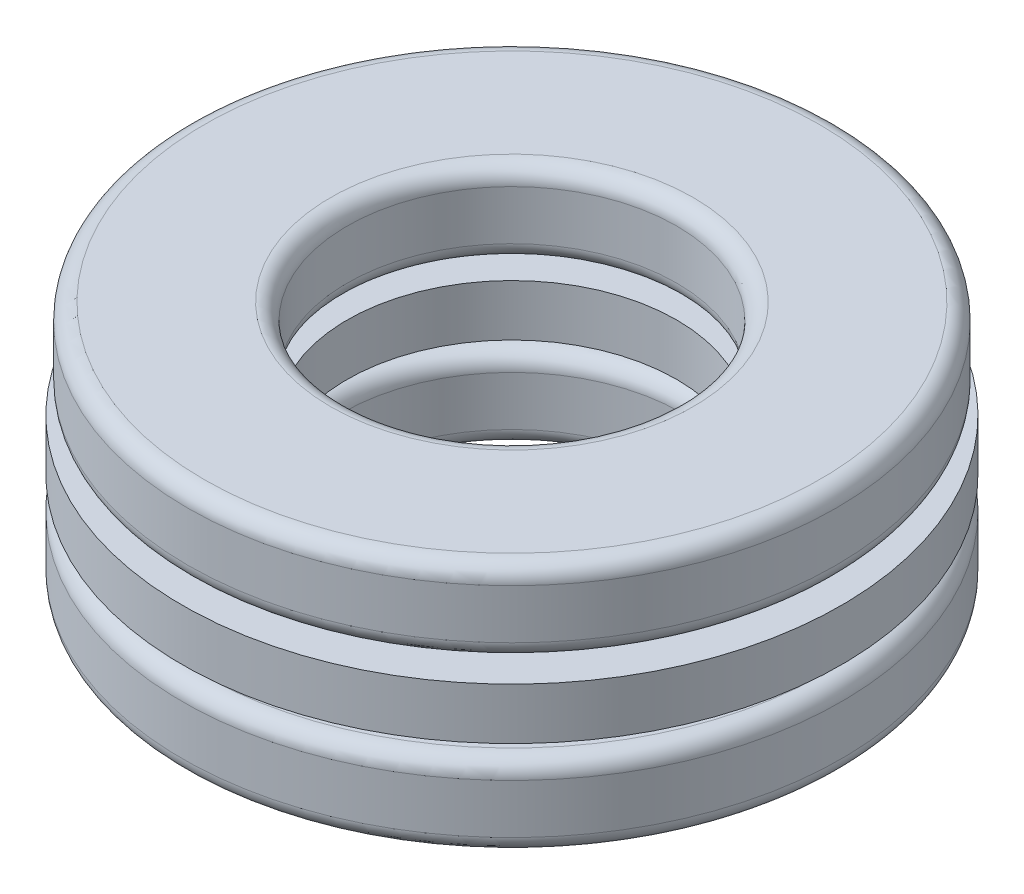
ISO-10303-21;
HEADER;
FILE_DESCRIPTION(('STEP AP214'),'2;1');
FILE_NAME('part.step','',(''),(''),'','','');
FILE_SCHEMA(('AUTOMOTIVE_DESIGN { 1 0 10303 214 1 1 1 1 }'));
ENDSEC;
DATA;
#1=APPLICATION_CONTEXT('core data for automotive mechanical design processes');
#2=APPLICATION_PROTOCOL_DEFINITION('international standard','automotive_design',2000,#1);
#3=PRODUCT_CONTEXT('',#1,'mechanical');
#4=PRODUCT('Part','Part','',(#3));
#5=PRODUCT_RELATED_PRODUCT_CATEGORY('part','',(#4));
#6=PRODUCT_DEFINITION_FORMATION('','',#4);
#7=PRODUCT_DEFINITION_CONTEXT('part definition',#1,'design');
#8=PRODUCT_DEFINITION('design','',#6,#7);
#9=PRODUCT_DEFINITION_SHAPE('','',#8);
#10=(LENGTH_UNIT() NAMED_UNIT(*) SI_UNIT(.MILLI.,.METRE.));
#11=(NAMED_UNIT(*) PLANE_ANGLE_UNIT() SI_UNIT($,.RADIAN.));
#12=(NAMED_UNIT(*) SI_UNIT($,.STERADIAN.) SOLID_ANGLE_UNIT());
#13=UNCERTAINTY_MEASURE_WITH_UNIT(LENGTH_MEASURE(1.E-05),#10,'distance_accuracy_value','');
#14=(GEOMETRIC_REPRESENTATION_CONTEXT(3) GLOBAL_UNCERTAINTY_ASSIGNED_CONTEXT((#13)) GLOBAL_UNIT_ASSIGNED_CONTEXT((#10,
#11,#12)) REPRESENTATION_CONTEXT('',''));
#15=CARTESIAN_POINT('',(0.,0.,0.));
#16=DIRECTION('',(0.,0.,1.));
#17=DIRECTION('',(1.,0.,0.));
#18=AXIS2_PLACEMENT_3D('',#15,#16,#17);
#19=CARTESIAN_POINT('',(0.,-1.05,0.));
#20=DIRECTION('',(0.,-1.,0.));
#21=DIRECTION('',(0.,0.,-1.));
#22=AXIS2_PLACEMENT_3D('',#19,#20,#21);
#23=TOROIDAL_SURFACE('',#22,3.4,0.3);
#24=CARTESIAN_POINT('',(0.,-0.749999999999999,0.));
#25=DIRECTION('',(0.,-1.,0.));
#26=DIRECTION('',(0.,0.,-1.));
#27=AXIS2_PLACEMENT_3D('',#24,#25,#26);
#28=CIRCLE('',#27,3.4);
#29=CARTESIAN_POINT('',(0.,-0.749999999999999,-3.4));
#30=VERTEX_POINT('',#29);
#31=EDGE_CURVE('E71',#30,#30,#28,.T.);
#32=ORIENTED_EDGE('',*,*,#31,.F.);
#33=EDGE_LOOP('',(#32));
#34=FACE_BOUND('',#33,.T.);
#35=CARTESIAN_POINT('',(0.,-1.05,0.));
#36=DIRECTION('',(0.,-1.,0.));
#37=DIRECTION('',(0.,0.,-1.));
#38=AXIS2_PLACEMENT_3D('',#35,#36,#37);
#39=CIRCLE('',#38,3.1);
#40=CARTESIAN_POINT('',(0.,-1.05,-3.1));
#41=VERTEX_POINT('',#40);
#42=EDGE_CURVE('E11',#41,#41,#39,.T.);
#43=ORIENTED_EDGE('',*,*,#42,.T.);
#44=EDGE_LOOP('',(#43));
#45=FACE_BOUND('',#44,.T.);
#46=ADVANCED_FACE('F43',(#34,#45),#23,.T.);
#47=CARTESIAN_POINT('',(0.,-2.25,0.));
#48=DIRECTION('',(0.,-1.,0.));
#49=DIRECTION('',(0.,0.,-1.));
#50=AXIS2_PLACEMENT_3D('',#47,#48,#49);
#51=CYLINDRICAL_SURFACE('',#50,3.1);
#52=ORIENTED_EDGE('',*,*,#42,.F.);
#53=EDGE_LOOP('',(#52));
#54=FACE_BOUND('',#53,.T.);
#55=CARTESIAN_POINT('',(0.,-1.95,0.));
#56=DIRECTION('',(0.,-1.,0.));
#57=DIRECTION('',(0.,0.,-1.));
#58=AXIS2_PLACEMENT_3D('',#55,#56,#57);
#59=CIRCLE('',#58,3.1);
#60=CARTESIAN_POINT('',(0.,-1.95,-3.1));
#61=VERTEX_POINT('',#60);
#62=EDGE_CURVE('E49',#61,#61,#59,.T.);
#63=ORIENTED_EDGE('',*,*,#62,.T.);
#64=EDGE_LOOP('',(#63));
#65=FACE_BOUND('',#64,.T.);
#66=ADVANCED_FACE('F78',(#54,#65),#51,.F.);
#67=CARTESIAN_POINT('',(0.,-1.95,0.));
#68=DIRECTION('',(0.,-1.,0.));
#69=DIRECTION('',(0.,0.,-1.));
#70=AXIS2_PLACEMENT_3D('',#67,#68,#69);
#71=TOROIDAL_SURFACE('',#70,3.4,0.3);
#72=ORIENTED_EDGE('',*,*,#62,.F.);
#73=EDGE_LOOP('',(#72));
#74=FACE_BOUND('',#73,.T.);
#75=CARTESIAN_POINT('',(0.,-2.25,0.));
#76=DIRECTION('',(0.,-1.,0.));
#77=DIRECTION('',(0.,0.,-1.));
#78=AXIS2_PLACEMENT_3D('',#75,#76,#77);
#79=CIRCLE('',#78,3.4);
#80=CARTESIAN_POINT('',(0.,-2.25,-3.4));
#81=VERTEX_POINT('',#80);
#82=EDGE_CURVE('E53',#81,#81,#79,.T.);
#83=ORIENTED_EDGE('',*,*,#82,.T.);
#84=EDGE_LOOP('',(#83));
#85=FACE_BOUND('',#84,.T.);
#86=ADVANCED_FACE('F82',(#74,#85),#71,.T.);
#87=CARTESIAN_POINT('',(0.,-2.25,5.7));
#88=DIRECTION('',(0.,1.,0.));
#89=DIRECTION('',(0.,0.,1.));
#90=AXIS2_PLACEMENT_3D('',#87,#88,#89);
#91=PLANE('',#90);
#92=ORIENTED_EDGE('',*,*,#82,.F.);
#93=EDGE_LOOP('',(#92));
#94=FACE_BOUND('',#93,.T.);
#95=CARTESIAN_POINT('',(0.,-2.25,0.));
#96=DIRECTION('',(0.,-1.,0.));
#97=DIRECTION('',(0.,0.,-1.));
#98=AXIS2_PLACEMENT_3D('',#95,#96,#97);
#99=CIRCLE('',#98,5.7);
#100=CARTESIAN_POINT('',(0.,-2.25,-5.7));
#101=VERTEX_POINT('',#100);
#102=EDGE_CURVE('E57',#101,#101,#99,.T.);
#103=ORIENTED_EDGE('',*,*,#102,.T.);
#104=EDGE_LOOP('',(#103));
#105=FACE_BOUND('',#104,.T.);
#106=ADVANCED_FACE('F87',(#94,#105),#91,.F.);
#107=CARTESIAN_POINT('',(0.,-1.95,0.));
#108=DIRECTION('',(0.,-1.,0.));
#109=DIRECTION('',(0.,0.,-1.));
#110=AXIS2_PLACEMENT_3D('',#107,#108,#109);
#111=TOROIDAL_SURFACE('',#110,5.7,0.299999999999999);
#112=ORIENTED_EDGE('',*,*,#102,.F.);
#113=EDGE_LOOP('',(#112));
#114=FACE_BOUND('',#113,.T.);
#115=CARTESIAN_POINT('',(0.,-1.95,0.));
#116=DIRECTION('',(0.,-1.,0.));
#117=DIRECTION('',(0.,0.,-1.));
#118=AXIS2_PLACEMENT_3D('',#115,#116,#117);
#119=CIRCLE('',#118,6.);
#120=CARTESIAN_POINT('',(0.,-1.95,-6.));
#121=VERTEX_POINT('',#120);
#122=EDGE_CURVE('E62',#121,#121,#119,.T.);
#123=ORIENTED_EDGE('',*,*,#122,.T.);
#124=EDGE_LOOP('',(#123));
#125=FACE_BOUND('',#124,.T.);
#126=ADVANCED_FACE('F93',(#114,#125),#111,.T.);
#127=CARTESIAN_POINT('',(0.,-2.25,0.));
#128=DIRECTION('',(0.,-1.,0.));
#129=DIRECTION('',(0.,0.,-1.));
#130=AXIS2_PLACEMENT_3D('',#127,#128,#129);
#131=CYLINDRICAL_SURFACE('',#130,6.);
#132=ORIENTED_EDGE('',*,*,#122,.F.);
#133=EDGE_LOOP('',(#132));
#134=FACE_BOUND('',#133,.T.);
#135=CARTESIAN_POINT('',(0.,-1.05,0.));
#136=DIRECTION('',(0.,-1.,0.));
#137=DIRECTION('',(0.,0.,-1.));
#138=AXIS2_PLACEMENT_3D('',#135,#136,#137);
#139=CIRCLE('',#138,6.);
#140=CARTESIAN_POINT('',(0.,-1.05,-6.));
#141=VERTEX_POINT('',#140);
#142=EDGE_CURVE('E65',#141,#141,#139,.T.);
#143=ORIENTED_EDGE('',*,*,#142,.T.);
#144=EDGE_LOOP('',(#143));
#145=FACE_BOUND('',#144,.T.);
#146=ADVANCED_FACE('F97',(#134,#145),#131,.T.);
#147=CARTESIAN_POINT('',(0.,-1.05,0.));
#148=DIRECTION('',(0.,-1.,0.));
#149=DIRECTION('',(0.,0.,-1.));
#150=AXIS2_PLACEMENT_3D('',#147,#148,#149);
#151=TOROIDAL_SURFACE('',#150,5.7,0.299999999999999);
#152=ORIENTED_EDGE('',*,*,#142,.F.);
#153=EDGE_LOOP('',(#152));
#154=FACE_BOUND('',#153,.T.);
#155=CARTESIAN_POINT('',(0.,-0.749999999999999,0.));
#156=DIRECTION('',(0.,-1.,0.));
#157=DIRECTION('',(0.,0.,-1.));
#158=AXIS2_PLACEMENT_3D('',#155,#156,#157);
#159=CIRCLE('',#158,5.7);
#160=CARTESIAN_POINT('',(0.,-0.749999999999999,-5.7));
#161=VERTEX_POINT('',#160);
#162=EDGE_CURVE('E68',#161,#161,#159,.T.);
#163=ORIENTED_EDGE('',*,*,#162,.T.);
#164=EDGE_LOOP('',(#163));
#165=FACE_BOUND('',#164,.T.);
#166=ADVANCED_FACE('F101',(#154,#165),#151,.T.);
#167=CARTESIAN_POINT('',(0.,-0.749999999999999,5.7));
#168=DIRECTION('',(0.,-1.,0.));
#169=DIRECTION('',(0.,0.,-1.));
#170=AXIS2_PLACEMENT_3D('',#167,#168,#169);
#171=PLANE('',#170);
#172=ORIENTED_EDGE('',*,*,#162,.F.);
#173=EDGE_LOOP('',(#172));
#174=FACE_BOUND('',#173,.T.);
#175=ORIENTED_EDGE('',*,*,#31,.T.);
#176=EDGE_LOOP('',(#175));
#177=FACE_BOUND('',#176,.T.);
#178=ADVANCED_FACE('F75',(#174,#177),#171,.F.);
#179=CLOSED_SHELL('',(#46,#66,#86,#106,#126,#146,#166,#178));
#180=MANIFOLD_SOLID_BREP('B2',#179);
#181=CARTESIAN_POINT('',(0.,1.05,0.));
#182=DIRECTION('',(0.,-1.,0.));
#183=DIRECTION('',(0.,0.,-1.));
#184=AXIS2_PLACEMENT_3D('',#181,#182,#183);
#185=TOROIDAL_SURFACE('',#184,3.3,0.3);
#186=CARTESIAN_POINT('',(0.,1.05,0.));
#187=DIRECTION('',(0.,-1.,0.));
#188=DIRECTION('',(0.,0.,-1.));
#189=AXIS2_PLACEMENT_3D('',#186,#187,#188);
#190=CIRCLE('',#189,3.);
#191=CARTESIAN_POINT('',(0.,1.05,-3.));
#192=VERTEX_POINT('',#191);
#193=EDGE_CURVE('E42',#192,#192,#190,.T.);
#194=ORIENTED_EDGE('',*,*,#193,.F.);
#195=EDGE_LOOP('',(#194));
#196=FACE_BOUND('',#195,.T.);
#197=CARTESIAN_POINT('',(0.,0.749999999999999,0.));
#198=DIRECTION('',(0.,-1.,0.));
#199=DIRECTION('',(0.,0.,-1.));
#200=AXIS2_PLACEMENT_3D('',#197,#198,#199);
#201=CIRCLE('',#200,3.3);
#202=CARTESIAN_POINT('',(0.,0.749999999999999,-3.3));
#203=VERTEX_POINT('',#202);
#204=EDGE_CURVE('E198',#203,#203,#201,.T.);
#205=ORIENTED_EDGE('',*,*,#204,.T.);
#206=EDGE_LOOP('',(#205));
#207=FACE_BOUND('',#206,.T.);
#208=ADVANCED_FACE('F170',(#196,#207),#185,.T.);
#209=CARTESIAN_POINT('',(0.,-2.25,0.));
#210=DIRECTION('',(0.,-1.,0.));
#211=DIRECTION('',(0.,0.,-1.));
#212=AXIS2_PLACEMENT_3D('',#209,#210,#211);
#213=CYLINDRICAL_SURFACE('',#212,3.);
#214=CARTESIAN_POINT('',(0.,1.95,0.));
#215=DIRECTION('',(0.,-1.,0.));
#216=DIRECTION('',(0.,0.,-1.));
#217=AXIS2_PLACEMENT_3D('',#214,#215,#216);
#218=CIRCLE('',#217,3.);
#219=CARTESIAN_POINT('',(0.,1.95,-3.));
#220=VERTEX_POINT('',#219);
#221=EDGE_CURVE('E176',#220,#220,#218,.T.);
#222=ORIENTED_EDGE('',*,*,#221,.F.);
#223=EDGE_LOOP('',(#222));
#224=FACE_BOUND('',#223,.T.);
#225=ORIENTED_EDGE('',*,*,#193,.T.);
#226=EDGE_LOOP('',(#225));
#227=FACE_BOUND('',#226,.T.);
#228=ADVANCED_FACE('F235',(#224,#227),#213,.F.);
#229=CARTESIAN_POINT('',(0.,1.95,0.));
#230=DIRECTION('',(0.,-1.,0.));
#231=DIRECTION('',(0.,0.,-1.));
#232=AXIS2_PLACEMENT_3D('',#229,#230,#231);
#233=TOROIDAL_SURFACE('',#232,3.3,0.3);
#234=CARTESIAN_POINT('',(0.,2.25,0.));
#235=DIRECTION('',(0.,-1.,0.));
#236=DIRECTION('',(0.,0.,-1.));
#237=AXIS2_PLACEMENT_3D('',#234,#235,#236);
#238=CIRCLE('',#237,3.3);
#239=CARTESIAN_POINT('',(0.,2.25,-3.3));
#240=VERTEX_POINT('',#239);
#241=EDGE_CURVE('E180',#240,#240,#238,.T.);
#242=ORIENTED_EDGE('',*,*,#241,.F.);
#243=EDGE_LOOP('',(#242));
#244=FACE_BOUND('',#243,.T.);
#245=ORIENTED_EDGE('',*,*,#221,.T.);
#246=EDGE_LOOP('',(#245));
#247=FACE_BOUND('',#246,.T.);
#248=ADVANCED_FACE('F230',(#244,#247),#233,.T.);
#249=CARTESIAN_POINT('',(0.,2.25,5.6));
#250=DIRECTION('',(0.,-1.,0.));
#251=DIRECTION('',(0.,0.,-1.));
#252=AXIS2_PLACEMENT_3D('',#249,#250,#251);
#253=PLANE('',#252);
#254=CARTESIAN_POINT('',(0.,2.25,0.));
#255=DIRECTION('',(0.,-1.,0.));
#256=DIRECTION('',(0.,0.,-1.));
#257=AXIS2_PLACEMENT_3D('',#254,#255,#256);
#258=CIRCLE('',#257,5.6);
#259=CARTESIAN_POINT('',(0.,2.25,-5.6));
#260=VERTEX_POINT('',#259);
#261=EDGE_CURVE('E184',#260,#260,#258,.T.);
#262=ORIENTED_EDGE('',*,*,#261,.F.);
#263=EDGE_LOOP('',(#262));
#264=FACE_BOUND('',#263,.T.);
#265=ORIENTED_EDGE('',*,*,#241,.T.);
#266=EDGE_LOOP('',(#265));
#267=FACE_BOUND('',#266,.T.);
#268=ADVANCED_FACE('F224',(#264,#267),#253,.F.);
#269=CARTESIAN_POINT('',(0.,1.95,0.));
#270=DIRECTION('',(0.,-1.,0.));
#271=DIRECTION('',(0.,0.,-1.));
#272=AXIS2_PLACEMENT_3D('',#269,#270,#271);
#273=TOROIDAL_SURFACE('',#272,5.6,0.3);
#274=CARTESIAN_POINT('',(0.,1.95,0.));
#275=DIRECTION('',(0.,-1.,0.));
#276=DIRECTION('',(0.,0.,-1.));
#277=AXIS2_PLACEMENT_3D('',#274,#275,#276);
#278=CIRCLE('',#277,5.9);
#279=CARTESIAN_POINT('',(0.,1.95,-5.9));
#280=VERTEX_POINT('',#279);
#281=EDGE_CURVE('E189',#280,#280,#278,.T.);
#282=ORIENTED_EDGE('',*,*,#281,.F.);
#283=EDGE_LOOP('',(#282));
#284=FACE_BOUND('',#283,.T.);
#285=ORIENTED_EDGE('',*,*,#261,.T.);
#286=EDGE_LOOP('',(#285));
#287=FACE_BOUND('',#286,.T.);
#288=ADVANCED_FACE('F218',(#284,#287),#273,.T.);
#289=CARTESIAN_POINT('',(0.,-2.25,0.));
#290=DIRECTION('',(0.,-1.,0.));
#291=DIRECTION('',(0.,0.,-1.));
#292=AXIS2_PLACEMENT_3D('',#289,#290,#291);
#293=CYLINDRICAL_SURFACE('',#292,5.9);
#294=CARTESIAN_POINT('',(0.,1.05,0.));
#295=DIRECTION('',(0.,-1.,0.));
#296=DIRECTION('',(0.,0.,-1.));
#297=AXIS2_PLACEMENT_3D('',#294,#295,#296);
#298=CIRCLE('',#297,5.9);
#299=CARTESIAN_POINT('',(0.,1.05,-5.9));
#300=VERTEX_POINT('',#299);
#301=EDGE_CURVE('E192',#300,#300,#298,.T.);
#302=ORIENTED_EDGE('',*,*,#301,.F.);
#303=EDGE_LOOP('',(#302));
#304=FACE_BOUND('',#303,.T.);
#305=ORIENTED_EDGE('',*,*,#281,.T.);
#306=EDGE_LOOP('',(#305));
#307=FACE_BOUND('',#306,.T.);
#308=ADVANCED_FACE('F212',(#304,#307),#293,.T.);
#309=CARTESIAN_POINT('',(0.,1.05,0.));
#310=DIRECTION('',(0.,-1.,0.));
#311=DIRECTION('',(0.,0.,-1.));
#312=AXIS2_PLACEMENT_3D('',#309,#310,#311);
#313=TOROIDAL_SURFACE('',#312,5.6,0.299999999999999);
#314=CARTESIAN_POINT('',(0.,0.749999999999999,0.));
#315=DIRECTION('',(0.,-1.,0.));
#316=DIRECTION('',(0.,0.,-1.));
#317=AXIS2_PLACEMENT_3D('',#314,#315,#316);
#318=CIRCLE('',#317,5.6);
#319=CARTESIAN_POINT('',(0.,0.749999999999999,-5.6));
#320=VERTEX_POINT('',#319);
#321=EDGE_CURVE('E195',#320,#320,#318,.T.);
#322=ORIENTED_EDGE('',*,*,#321,.F.);
#323=EDGE_LOOP('',(#322));
#324=FACE_BOUND('',#323,.T.);
#325=ORIENTED_EDGE('',*,*,#301,.T.);
#326=EDGE_LOOP('',(#325));
#327=FACE_BOUND('',#326,.T.);
#328=ADVANCED_FACE('F206',(#324,#327),#313,.T.);
#329=CARTESIAN_POINT('',(0.,0.749999999999999,5.6));
#330=DIRECTION('',(0.,1.,0.));
#331=DIRECTION('',(0.,0.,1.));
#332=AXIS2_PLACEMENT_3D('',#329,#330,#331);
#333=PLANE('',#332);
#334=ORIENTED_EDGE('',*,*,#204,.F.);
#335=EDGE_LOOP('',(#334));
#336=FACE_BOUND('',#335,.T.);
#337=ORIENTED_EDGE('',*,*,#321,.T.);
#338=EDGE_LOOP('',(#337));
#339=FACE_BOUND('',#338,.T.);
#340=ADVANCED_FACE('F203',(#336,#339),#333,.F.);
#341=CLOSED_SHELL('',(#208,#228,#248,#268,#288,#308,#328,#340));
#342=MANIFOLD_SOLID_BREP('B6',#341);
#343=CARTESIAN_POINT('',(-4.27975432332818,0.,1.39057647468731));
#344=DIRECTION('',(0.,1.,0.));
#345=DIRECTION('',(0.95105651629515,0.,-0.309016994374958));
#346=AXIS2_PLACEMENT_3D('',#343,#344,#345);
#347=SPHERICAL_SURFACE('',#346,0.75);
#348=CARTESIAN_POINT('',(-4.27975432332818,0.75,1.39057647468731));
#349=VERTEX_POINT('',#348);
#350=VERTEX_LOOP('',#349);
#351=FACE_BOUND('',#350,.T.);
#352=ADVANCED_FACE('F297',(#351),#347,.T.);
#353=CLOSED_SHELL('',(#352));
#354=MANIFOLD_SOLID_BREP('B37',#353);
#355=CARTESIAN_POINT('',(-2.64503363531616,0.,-3.64057647468724));
#356=DIRECTION('',(0.,1.,0.));
#357=DIRECTION('',(0.58778525229248,0.,0.809016994374942));
#358=AXIS2_PLACEMENT_3D('',#355,#356,#357);
#359=SPHERICAL_SURFACE('',#358,0.75);
#360=CARTESIAN_POINT('',(-2.64503363531616,0.75,-3.64057647468724));
#361=VERTEX_POINT('',#360);
#362=VERTEX_LOOP('',#361);
#363=FACE_BOUND('',#362,.T.);
#364=ADVANCED_FACE('F315',(#363),#359,.T.);
#365=CLOSED_SHELL('',(#364));
#366=MANIFOLD_SOLID_BREP('B166',#365);
#367=CARTESIAN_POINT('',(2.64503363531611,0.,-3.64057647468728));
#368=DIRECTION('',(0.,1.,0.));
#369=DIRECTION('',(-0.587785252292469,0.,0.809016994374951));
#370=AXIS2_PLACEMENT_3D('',#367,#368,#369);
#371=SPHERICAL_SURFACE('',#370,0.75);
#372=CARTESIAN_POINT('',(2.64503363531611,0.75,-3.64057647468728));
#373=VERTEX_POINT('',#372);
#374=VERTEX_LOOP('',#373);
#375=FACE_BOUND('',#374,.T.);
#376=ADVANCED_FACE('F333',(#375),#371,.T.);
#377=CLOSED_SHELL('',(#376));
#378=MANIFOLD_SOLID_BREP('B293',#377);
#379=CARTESIAN_POINT('',(4.2797543233282,0.,1.39057647468725));
#380=DIRECTION('',(0.,1.,0.));
#381=DIRECTION('',(-0.951056516295155,0.,-0.309016994374945));
#382=AXIS2_PLACEMENT_3D('',#379,#380,#381);
#383=SPHERICAL_SURFACE('',#382,0.75);
#384=CARTESIAN_POINT('',(4.2797543233282,0.75,1.39057647468725));
#385=VERTEX_POINT('',#384);
#386=VERTEX_LOOP('',#385);
#387=FACE_BOUND('',#386,.T.);
#388=ADVANCED_FACE('F351',(#387),#383,.T.);
#389=CLOSED_SHELL('',(#388));
#390=MANIFOLD_SOLID_BREP('B311',#389);
#391=CARTESIAN_POINT('',(0.,0.,4.5));
#392=DIRECTION('',(0.,1.,0.));
#393=DIRECTION('',(0.,0.,-1.));
#394=AXIS2_PLACEMENT_3D('',#391,#392,#393);
#395=SPHERICAL_SURFACE('',#394,0.75);
#396=CARTESIAN_POINT('',(0.,0.75,4.5));
#397=VERTEX_POINT('',#396);
#398=VERTEX_LOOP('',#397);
#399=FACE_BOUND('',#398,.T.);
#400=ADVANCED_FACE('F370',(#399),#395,.T.);
#401=CLOSED_SHELL('',(#400));
#402=MANIFOLD_SOLID_BREP('B329',#401);
#403=CARTESIAN_POINT('',(0.,-2.25,0.));
#404=DIRECTION('',(0.,-1.,0.));
#405=DIRECTION('',(0.,0.,-1.));
#406=AXIS2_PLACEMENT_3D('',#403,#404,#405);
#407=CYLINDRICAL_SURFACE('',#406,6.);
#408=CARTESIAN_POINT('',(0.,-0.468750000000001,0.));
#409=DIRECTION('',(0.,-1.,0.));
#410=DIRECTION('',(0.,0.,-1.));
#411=AXIS2_PLACEMENT_3D('',#408,#409,#410);
#412=CIRCLE('',#411,6.);
#413=CARTESIAN_POINT('',(0.,-0.468750000000001,-6.));
#414=VERTEX_POINT('',#413);
#415=EDGE_CURVE('E369',#414,#414,#412,.T.);
#416=ORIENTED_EDGE('',*,*,#415,.F.);
#417=EDGE_LOOP('',(#416));
#418=FACE_BOUND('',#417,.T.);
#419=CARTESIAN_POINT('',(0.,0.468749999999999,0.));
#420=DIRECTION('',(0.,-1.,0.));
#421=DIRECTION('',(0.,0.,-1.));
#422=AXIS2_PLACEMENT_3D('',#419,#420,#421);
#423=CIRCLE('',#422,6.);
#424=CARTESIAN_POINT('',(0.,0.468749999999999,-6.));
#425=VERTEX_POINT('',#424);
#426=EDGE_CURVE('E398',#425,#425,#423,.T.);
#427=ORIENTED_EDGE('',*,*,#426,.T.);
#428=EDGE_LOOP('',(#427));
#429=FACE_BOUND('',#428,.T.);
#430=ADVANCED_FACE('F382',(#418,#429),#407,.T.);
#431=CARTESIAN_POINT('',(0.,-0.468750000000001,6.));
#432=DIRECTION('',(0.,1.,0.));
#433=DIRECTION('',(0.,0.,1.));
#434=AXIS2_PLACEMENT_3D('',#431,#432,#433);
#435=PLANE('',#434);
#436=CARTESIAN_POINT('',(-4.27975432332818,-0.468750000000001,1.39057647468731));
#437=DIRECTION('',(0.,1.,0.));
#438=DIRECTION('',(-0.95105651629515,0.,0.309016994374958));
#439=AXIS2_PLACEMENT_3D('',#436,#437,#438);
#440=CIRCLE('',#439,0.585468562349849);
#441=CARTESIAN_POINT('',(-4.83656801463695,-0.468750000000001,1.57149621012569));
#442=VERTEX_POINT('',#441);
#443=EDGE_CURVE('E422',#442,#442,#440,.T.);
#444=ORIENTED_EDGE('',*,*,#443,.T.);
#445=EDGE_LOOP('',(#444));
#446=FACE_BOUND('',#445,.T.);
#447=CARTESIAN_POINT('',(-2.64503363531616,-0.468750000000001,-3.64057647468724));
#448=DIRECTION('',(0.,1.,0.));
#449=DIRECTION('',(-0.58778525229248,0.,-0.809016994374942));
#450=AXIS2_PLACEMENT_3D('',#447,#448,#449);
#451=CIRCLE('',#450,0.585468562349849);
#452=CARTESIAN_POINT('',(-2.98916342194628,-0.468750000000001,-4.11423049130053));
#453=VERTEX_POINT('',#452);
#454=EDGE_CURVE('E416',#453,#453,#451,.T.);
#455=ORIENTED_EDGE('',*,*,#454,.T.);
#456=EDGE_LOOP('',(#455));
#457=FACE_BOUND('',#456,.T.);
#458=CARTESIAN_POINT('',(2.64503363531611,-0.468750000000001,-3.64057647468728));
#459=DIRECTION('',(0.,1.,0.));
#460=DIRECTION('',(0.587785252292469,0.,-0.809016994374951));
#461=AXIS2_PLACEMENT_3D('',#458,#459,#460);
#462=CIRCLE('',#461,0.585468562349849);
#463=CARTESIAN_POINT('',(2.98916342194622,-0.468750000000001,-4.11423049130058));
#464=VERTEX_POINT('',#463);
#465=EDGE_CURVE('E410',#464,#464,#462,.T.);
#466=ORIENTED_EDGE('',*,*,#465,.T.);
#467=EDGE_LOOP('',(#466));
#468=FACE_BOUND('',#467,.T.);
#469=CARTESIAN_POINT('',(4.2797543233282,-0.468750000000001,1.39057647468725));
#470=DIRECTION('',(0.,1.,0.));
#471=DIRECTION('',(0.951056516295155,0.,0.309016994374945));
#472=AXIS2_PLACEMENT_3D('',#469,#470,#471);
#473=CIRCLE('',#472,0.585468562349849);
#474=CARTESIAN_POINT('',(4.83656801463698,-0.468750000000001,1.57149621012562));
#475=VERTEX_POINT('',#474);
#476=EDGE_CURVE('E404',#475,#475,#473,.T.);
#477=ORIENTED_EDGE('',*,*,#476,.T.);
#478=EDGE_LOOP('',(#477));
#479=FACE_BOUND('',#478,.T.);
#480=CARTESIAN_POINT('',(0.,-0.468750000000001,4.5));
#481=DIRECTION('',(0.,1.,0.));
#482=DIRECTION('',(0.,0.,1.));
#483=AXIS2_PLACEMENT_3D('',#480,#481,#482);
#484=CIRCLE('',#483,0.585468562349849);
#485=CARTESIAN_POINT('',(0.,-0.468750000000001,5.08546856234985));
#486=VERTEX_POINT('',#485);
#487=EDGE_CURVE('E401',#486,#486,#484,.T.);
#488=ORIENTED_EDGE('',*,*,#487,.T.);
#489=EDGE_LOOP('',(#488));
#490=FACE_BOUND('',#489,.T.);
#491=CARTESIAN_POINT('',(0.,-0.468750000000001,0.));
#492=DIRECTION('',(0.,-1.,0.));
#493=DIRECTION('',(0.,0.,-1.));
#494=AXIS2_PLACEMENT_3D('',#491,#492,#493);
#495=CIRCLE('',#494,3.);
#496=CARTESIAN_POINT('',(0.,-0.468750000000001,-3.));
#497=VERTEX_POINT('',#496);
#498=EDGE_CURVE('E389',#497,#497,#495,.T.);
#499=ORIENTED_EDGE('',*,*,#498,.F.);
#500=EDGE_LOOP('',(#499));
#501=FACE_BOUND('',#500,.T.);
#502=ORIENTED_EDGE('',*,*,#415,.T.);
#503=EDGE_LOOP('',(#502));
#504=FACE_BOUND('',#503,.T.);
#505=ADVANCED_FACE('F439',(#446,#457,#468,#479,#490,#501,#504),#435,.F.);
#506=CARTESIAN_POINT('',(0.,-2.25,0.));
#507=DIRECTION('',(0.,-1.,0.));
#508=DIRECTION('',(0.,0.,-1.));
#509=AXIS2_PLACEMENT_3D('',#506,#507,#508);
#510=CYLINDRICAL_SURFACE('',#509,3.);
#511=CARTESIAN_POINT('',(0.,0.46875,0.));
#512=DIRECTION('',(0.,-1.,0.));
#513=DIRECTION('',(0.,0.,-1.));
#514=AXIS2_PLACEMENT_3D('',#511,#512,#513);
#515=CIRCLE('',#514,3.);
#516=CARTESIAN_POINT('',(0.,0.46875,-3.));
#517=VERTEX_POINT('',#516);
#518=EDGE_CURVE('E393',#517,#517,#515,.T.);
#519=ORIENTED_EDGE('',*,*,#518,.F.);
#520=EDGE_LOOP('',(#519));
#521=FACE_BOUND('',#520,.T.);
#522=ORIENTED_EDGE('',*,*,#498,.T.);
#523=EDGE_LOOP('',(#522));
#524=FACE_BOUND('',#523,.T.);
#525=ADVANCED_FACE('F442',(#521,#524),#510,.F.);
#526=CARTESIAN_POINT('',(0.,0.46875,6.));
#527=DIRECTION('',(0.,-1.,0.));
#528=DIRECTION('',(0.,0.,-1.));
#529=AXIS2_PLACEMENT_3D('',#526,#527,#528);
#530=PLANE('',#529);
#531=CARTESIAN_POINT('',(-4.27975432332818,0.46875,1.39057647468731));
#532=DIRECTION('',(0.,-1.,0.));
#533=DIRECTION('',(0.95105651629515,0.,-0.309016994374958));
#534=AXIS2_PLACEMENT_3D('',#531,#532,#533);
#535=CIRCLE('',#534,0.58546856234985);
#536=CARTESIAN_POINT('',(-3.7229406320194,0.46875,1.20965673924893));
#537=VERTEX_POINT('',#536);
#538=EDGE_CURVE('E425',#537,#537,#535,.T.);
#539=ORIENTED_EDGE('',*,*,#538,.T.);
#540=EDGE_LOOP('',(#539));
#541=FACE_BOUND('',#540,.T.);
#542=CARTESIAN_POINT('',(-2.64503363531616,0.46875,-3.64057647468724));
#543=DIRECTION('',(0.,-1.,0.));
#544=DIRECTION('',(0.58778525229248,0.,0.809016994374942));
#545=AXIS2_PLACEMENT_3D('',#542,#543,#544);
#546=CIRCLE('',#545,0.58546856234985);
#547=CARTESIAN_POINT('',(-2.30090384868604,0.46875,-3.16692245807395));
#548=VERTEX_POINT('',#547);
#549=EDGE_CURVE('E419',#548,#548,#546,.T.);
#550=ORIENTED_EDGE('',*,*,#549,.T.);
#551=EDGE_LOOP('',(#550));
#552=FACE_BOUND('',#551,.T.);
#553=CARTESIAN_POINT('',(2.64503363531611,0.46875,-3.64057647468728));
#554=DIRECTION('',(0.,-1.,0.));
#555=DIRECTION('',(-0.587785252292469,0.,0.809016994374951));
#556=AXIS2_PLACEMENT_3D('',#553,#554,#555);
#557=CIRCLE('',#556,0.58546856234985);
#558=CARTESIAN_POINT('',(2.30090384868599,0.46875,-3.16692245807398));
#559=VERTEX_POINT('',#558);
#560=EDGE_CURVE('E413',#559,#559,#557,.T.);
#561=ORIENTED_EDGE('',*,*,#560,.T.);
#562=EDGE_LOOP('',(#561));
#563=FACE_BOUND('',#562,.T.);
#564=CARTESIAN_POINT('',(4.2797543233282,0.46875,1.39057647468725));
#565=DIRECTION('',(0.,-1.,0.));
#566=DIRECTION('',(-0.951056516295155,0.,-0.309016994374945));
#567=AXIS2_PLACEMENT_3D('',#564,#565,#566);
#568=CIRCLE('',#567,0.58546856234985);
#569=CARTESIAN_POINT('',(3.72294063201942,0.46875,1.20965673924888));
#570=VERTEX_POINT('',#569);
#571=EDGE_CURVE('E407',#570,#570,#568,.T.);
#572=ORIENTED_EDGE('',*,*,#571,.T.);
#573=EDGE_LOOP('',(#572));
#574=FACE_BOUND('',#573,.T.);
#575=CARTESIAN_POINT('',(0.,0.46875,4.5));
#576=DIRECTION('',(0.,-1.,0.));
#577=DIRECTION('',(0.,0.,-1.));
#578=AXIS2_PLACEMENT_3D('',#575,#576,#577);
#579=CIRCLE('',#578,0.58546856234985);
#580=CARTESIAN_POINT('',(0.,0.46875,3.91453143765015));
#581=VERTEX_POINT('',#580);
#582=EDGE_CURVE('E385',#581,#581,#579,.T.);
#583=ORIENTED_EDGE('',*,*,#582,.T.);
#584=EDGE_LOOP('',(#583));
#585=FACE_BOUND('',#584,.T.);
#586=ORIENTED_EDGE('',*,*,#426,.F.);
#587=EDGE_LOOP('',(#586));
#588=FACE_BOUND('',#587,.T.);
#589=ORIENTED_EDGE('',*,*,#518,.T.);
#590=EDGE_LOOP('',(#589));
#591=FACE_BOUND('',#590,.T.);
#592=ADVANCED_FACE('F429',(#541,#552,#563,#574,#585,#588,#591),#530,.F.);
#593=CARTESIAN_POINT('',(0.,0.,4.5));
#594=DIRECTION('',(0.,1.,0.));
#595=DIRECTION('',(0.,0.,-1.));
#596=AXIS2_PLACEMENT_3D('',#593,#594,#595);
#597=SPHERICAL_SURFACE('',#596,0.75);
#598=ORIENTED_EDGE('',*,*,#582,.F.);
#599=EDGE_LOOP('',(#598));
#600=FACE_BOUND('',#599,.T.);
#601=ORIENTED_EDGE('',*,*,#487,.F.);
#602=EDGE_LOOP('',(#601));
#603=FACE_BOUND('',#602,.T.);
#604=ADVANCED_FACE('F459',(#600,#603),#597,.F.);
#605=CARTESIAN_POINT('',(4.2797543233282,0.,1.39057647468725));
#606=DIRECTION('',(0.,1.,0.));
#607=DIRECTION('',(-0.951056516295155,0.,-0.309016994374945));
#608=AXIS2_PLACEMENT_3D('',#605,#606,#607);
#609=SPHERICAL_SURFACE('',#608,0.75);
#610=ORIENTED_EDGE('',*,*,#571,.F.);
#611=EDGE_LOOP('',(#610));
#612=FACE_BOUND('',#611,.T.);
#613=ORIENTED_EDGE('',*,*,#476,.F.);
#614=EDGE_LOOP('',(#613));
#615=FACE_BOUND('',#614,.T.);
#616=ADVANCED_FACE('F490',(#612,#615),#609,.F.);
#617=CARTESIAN_POINT('',(2.64503363531611,0.,-3.64057647468728));
#618=DIRECTION('',(0.,1.,0.));
#619=DIRECTION('',(-0.587785252292469,0.,0.809016994374951));
#620=AXIS2_PLACEMENT_3D('',#617,#618,#619);
#621=SPHERICAL_SURFACE('',#620,0.75);
#622=ORIENTED_EDGE('',*,*,#560,.F.);
#623=EDGE_LOOP('',(#622));
#624=FACE_BOUND('',#623,.T.);
#625=ORIENTED_EDGE('',*,*,#465,.F.);
#626=EDGE_LOOP('',(#625));
#627=FACE_BOUND('',#626,.T.);
#628=ADVANCED_FACE('F495',(#624,#627),#621,.F.);
#629=CARTESIAN_POINT('',(-2.64503363531616,0.,-3.64057647468724));
#630=DIRECTION('',(0.,1.,0.));
#631=DIRECTION('',(0.58778525229248,0.,0.809016994374942));
#632=AXIS2_PLACEMENT_3D('',#629,#630,#631);
#633=SPHERICAL_SURFACE('',#632,0.75);
#634=ORIENTED_EDGE('',*,*,#549,.F.);
#635=EDGE_LOOP('',(#634));
#636=FACE_BOUND('',#635,.T.);
#637=ORIENTED_EDGE('',*,*,#454,.F.);
#638=EDGE_LOOP('',(#637));
#639=FACE_BOUND('',#638,.T.);
#640=ADVANCED_FACE('F435',(#636,#639),#633,.F.);
#641=CARTESIAN_POINT('',(-4.27975432332818,0.,1.39057647468731));
#642=DIRECTION('',(0.,1.,0.));
#643=DIRECTION('',(0.95105651629515,0.,-0.309016994374958));
#644=AXIS2_PLACEMENT_3D('',#641,#642,#643);
#645=SPHERICAL_SURFACE('',#644,0.75);
#646=ORIENTED_EDGE('',*,*,#538,.F.);
#647=EDGE_LOOP('',(#646));
#648=FACE_BOUND('',#647,.T.);
#649=ORIENTED_EDGE('',*,*,#443,.F.);
#650=EDGE_LOOP('',(#649));
#651=FACE_BOUND('',#650,.T.);
#652=ADVANCED_FACE('F432',(#648,#651),#645,.F.);
#653=CLOSED_SHELL('',(#430,#505,#525,#592,#604,#616,#628,#640,#652));
#654=MANIFOLD_SOLID_BREP('B347',#653);
#655=ADVANCED_BREP_SHAPE_REPRESENTATION('',(#18,#180,#342,#354,#366,#378,#390,#402,#654),#14);
#656=SHAPE_DEFINITION_REPRESENTATION(#9,#655);
ENDSEC;
END-ISO-10303-21;
